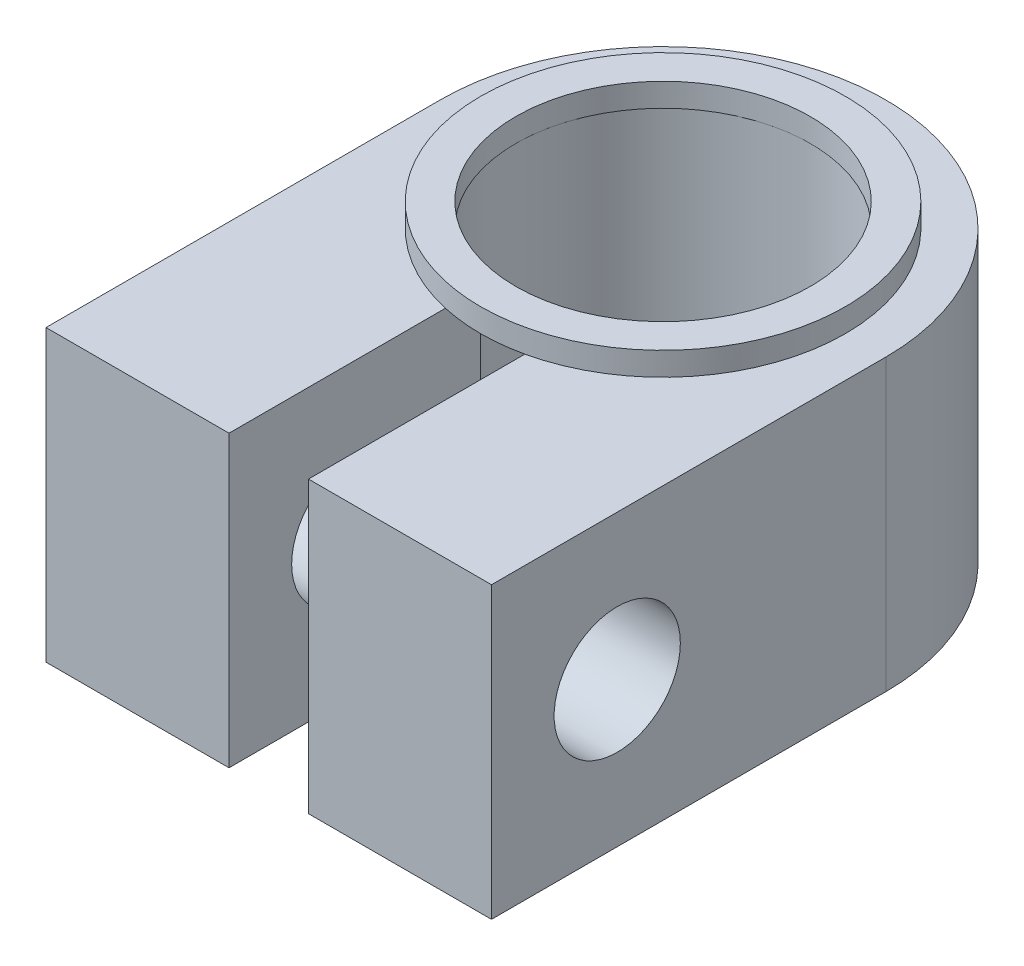
ISO-10303-21;
HEADER;
FILE_DESCRIPTION(('STEP AP214'),'2;1');
FILE_NAME('part.step','',(''),(''),'','','');
FILE_SCHEMA(('AUTOMOTIVE_DESIGN { 1 0 10303 214 1 1 1 1 }'));
ENDSEC;
DATA;
#1=APPLICATION_CONTEXT('core data for automotive mechanical design processes');
#2=APPLICATION_PROTOCOL_DEFINITION('international standard','automotive_design',2000,#1);
#3=PRODUCT_CONTEXT('',#1,'mechanical');
#4=PRODUCT('Part','Part','',(#3));
#5=PRODUCT_RELATED_PRODUCT_CATEGORY('part','',(#4));
#6=PRODUCT_DEFINITION_FORMATION('','',#4);
#7=PRODUCT_DEFINITION_CONTEXT('part definition',#1,'design');
#8=PRODUCT_DEFINITION('design','',#6,#7);
#9=PRODUCT_DEFINITION_SHAPE('','',#8);
#10=(LENGTH_UNIT() NAMED_UNIT(*) SI_UNIT(.MILLI.,.METRE.));
#11=(NAMED_UNIT(*) PLANE_ANGLE_UNIT() SI_UNIT($,.RADIAN.));
#12=(NAMED_UNIT(*) SI_UNIT($,.STERADIAN.) SOLID_ANGLE_UNIT());
#13=UNCERTAINTY_MEASURE_WITH_UNIT(LENGTH_MEASURE(1.E-05),#10,'distance_accuracy_value','');
#14=(GEOMETRIC_REPRESENTATION_CONTEXT(3) GLOBAL_UNCERTAINTY_ASSIGNED_CONTEXT((#13)) GLOBAL_UNIT_ASSIGNED_CONTEXT((#10,
#11,#12)) REPRESENTATION_CONTEXT('',''));
#15=CARTESIAN_POINT('',(0.,0.,0.));
#16=DIRECTION('',(0.,0.,1.));
#17=DIRECTION('',(1.,0.,0.));
#18=AXIS2_PLACEMENT_3D('',#15,#16,#17);
#19=CARTESIAN_POINT('',(0.,6.2,2.325));
#20=DIRECTION('',(0.,0.,-1.));
#21=DIRECTION('',(-1.,0.,0.));
#22=AXIS2_PLACEMENT_3D('',#19,#20,#21);
#23=PLANE('',#22);
#24=DIRECTION('',(1.,0.,0.));
#25=VECTOR('',#24,1.);
#26=CARTESIAN_POINT('',(0.,0.,2.325));
#27=LINE('',#26,#25);
#28=CARTESIAN_POINT('',(-4.765,0.,2.325));
#29=VERTEX_POINT('',#28);
#30=CARTESIAN_POINT('',(-0.85,0.,2.325));
#31=VERTEX_POINT('',#30);
#32=EDGE_CURVE('E165',#29,#31,#27,.T.);
#33=ORIENTED_EDGE('',*,*,#32,.T.);
#34=DIRECTION('',(0.,1.,0.));
#35=VECTOR('',#34,1.);
#36=CARTESIAN_POINT('',(-0.85,0.,2.325));
#37=LINE('',#36,#35);
#38=CARTESIAN_POINT('',(-0.85,6.2,2.325));
#39=VERTEX_POINT('',#38);
#40=EDGE_CURVE('E149',#31,#39,#37,.T.);
#41=ORIENTED_EDGE('',*,*,#40,.T.);
#42=DIRECTION('',(1.,0.,0.));
#43=VECTOR('',#42,1.);
#44=CARTESIAN_POINT('',(0.,6.2,2.325));
#45=LINE('',#44,#43);
#46=CARTESIAN_POINT('',(-4.765,6.2,2.325));
#47=VERTEX_POINT('',#46);
#48=EDGE_CURVE('E121',#47,#39,#45,.T.);
#49=ORIENTED_EDGE('',*,*,#48,.F.);
#50=DIRECTION('',(0.,-1.,0.));
#51=VECTOR('',#50,1.);
#52=CARTESIAN_POINT('',(-4.765,6.2,2.325));
#53=LINE('',#52,#51);
#54=EDGE_CURVE('E183',#47,#29,#53,.T.);
#55=ORIENTED_EDGE('',*,*,#54,.T.);
#56=EDGE_LOOP('',(#33,#41,#49,#55));
#57=FACE_BOUND('',#56,.T.);
#58=ADVANCED_FACE('F35',(#57),#23,.F.);
#59=CARTESIAN_POINT('',(4.765,6.2,0.));
#60=DIRECTION('',(1.,0.,0.));
#61=DIRECTION('',(0.,0.,-1.));
#62=AXIS2_PLACEMENT_3D('',#59,#60,#61);
#63=PLANE('',#62);
#64=CARTESIAN_POINT('',(4.765,3.1,-0.365));
#65=DIRECTION('',(1.,0.,0.));
#66=DIRECTION('',(0.,0.,-1.));
#67=AXIS2_PLACEMENT_3D('',#64,#65,#66);
#68=CIRCLE('',#67,1.35);
#69=CARTESIAN_POINT('',(4.765,3.1,-1.715));
#70=VERTEX_POINT('',#69);
#71=EDGE_CURVE('E131',#70,#70,#68,.T.);
#72=ORIENTED_EDGE('',*,*,#71,.F.);
#73=EDGE_LOOP('',(#72));
#74=FACE_BOUND('',#73,.T.);
#75=DIRECTION('',(0.,0.,1.));
#76=VECTOR('',#75,1.);
#77=CARTESIAN_POINT('',(4.765,0.,0.));
#78=LINE('',#77,#76);
#79=CARTESIAN_POINT('',(4.765,0.,-6.11));
#80=VERTEX_POINT('',#79);
#81=CARTESIAN_POINT('',(4.765,0.,2.325));
#82=VERTEX_POINT('',#81);
#83=EDGE_CURVE('E159',#80,#82,#78,.T.);
#84=ORIENTED_EDGE('',*,*,#83,.F.);
#85=DIRECTION('',(0.,-1.,0.));
#86=VECTOR('',#85,1.);
#87=CARTESIAN_POINT('',(4.765,6.2,-6.11));
#88=LINE('',#87,#86);
#89=CARTESIAN_POINT('',(4.765,6.2,-6.11));
#90=VERTEX_POINT('',#89);
#91=EDGE_CURVE('E189',#90,#80,#88,.T.);
#92=ORIENTED_EDGE('',*,*,#91,.F.);
#93=DIRECTION('',(0.,0.,1.));
#94=VECTOR('',#93,1.);
#95=CARTESIAN_POINT('',(4.765,6.2,0.));
#96=LINE('',#95,#94);
#97=CARTESIAN_POINT('',(4.765,6.2,2.325));
#98=VERTEX_POINT('',#97);
#99=EDGE_CURVE('E161',#90,#98,#96,.T.);
#100=ORIENTED_EDGE('',*,*,#99,.T.);
#101=DIRECTION('',(0.,-1.,0.));
#102=VECTOR('',#101,1.);
#103=CARTESIAN_POINT('',(4.765,6.2,2.325));
#104=LINE('',#103,#102);
#105=EDGE_CURVE('E171',#98,#82,#104,.T.);
#106=ORIENTED_EDGE('',*,*,#105,.T.);
#107=EDGE_LOOP('',(#84,#92,#100,#106));
#108=FACE_BOUND('',#107,.T.);
#109=ADVANCED_FACE('F37',(#74,#108),#63,.T.);
#110=CARTESIAN_POINT('',(0.,6.2,-6.11));
#111=DIRECTION('',(0.,-1.,0.));
#112=DIRECTION('',(0.,0.,-1.));
#113=AXIS2_PLACEMENT_3D('',#110,#111,#112);
#114=CYLINDRICAL_SURFACE('',#113,4.765);
#115=CARTESIAN_POINT('',(0.,0.,-6.11));
#116=DIRECTION('',(0.,1.,0.));
#117=DIRECTION('',(0.,0.,1.));
#118=AXIS2_PLACEMENT_3D('',#115,#116,#117);
#119=CIRCLE('',#118,4.765);
#120=CARTESIAN_POINT('',(-4.765,0.,-6.11));
#121=VERTEX_POINT('',#120);
#122=EDGE_CURVE('E174',#80,#121,#119,.T.);
#123=ORIENTED_EDGE('',*,*,#122,.T.);
#124=DIRECTION('',(0.,-1.,0.));
#125=VECTOR('',#124,1.);
#126=CARTESIAN_POINT('',(-4.765,6.2,-6.11));
#127=LINE('',#126,#125);
#128=CARTESIAN_POINT('',(-4.765,6.2,-6.11));
#129=VERTEX_POINT('',#128);
#130=EDGE_CURVE('E186',#129,#121,#127,.T.);
#131=ORIENTED_EDGE('',*,*,#130,.F.);
#132=CARTESIAN_POINT('',(0.,6.2,-6.11));
#133=DIRECTION('',(0.,1.,0.));
#134=DIRECTION('',(0.,0.,1.));
#135=AXIS2_PLACEMENT_3D('',#132,#133,#134);
#136=CIRCLE('',#135,4.765);
#137=EDGE_CURVE('E164',#90,#129,#136,.T.);
#138=ORIENTED_EDGE('',*,*,#137,.F.);
#139=ORIENTED_EDGE('',*,*,#91,.T.);
#140=EDGE_LOOP('',(#123,#131,#138,#139));
#141=FACE_BOUND('',#140,.T.);
#142=ADVANCED_FACE('F217',(#141),#114,.T.);
#143=CARTESIAN_POINT('',(-4.765,6.2,0.));
#144=DIRECTION('',(1.,0.,0.));
#145=DIRECTION('',(0.,0.,-1.));
#146=AXIS2_PLACEMENT_3D('',#143,#144,#145);
#147=PLANE('',#146);
#148=CARTESIAN_POINT('',(-4.765,3.1,-0.365000000000002));
#149=DIRECTION('',(1.,0.,0.));
#150=DIRECTION('',(0.,0.,-1.));
#151=AXIS2_PLACEMENT_3D('',#148,#149,#150);
#152=CIRCLE('',#151,1.35);
#153=CARTESIAN_POINT('',(-4.765,3.1,-1.715));
#154=VERTEX_POINT('',#153);
#155=EDGE_CURVE('E135',#154,#154,#152,.T.);
#156=ORIENTED_EDGE('',*,*,#155,.T.);
#157=EDGE_LOOP('',(#156));
#158=FACE_BOUND('',#157,.T.);
#159=DIRECTION('',(0.,0.,1.));
#160=VECTOR('',#159,1.);
#161=CARTESIAN_POINT('',(-4.765,0.,0.));
#162=LINE('',#161,#160);
#163=EDGE_CURVE('E176',#121,#29,#162,.T.);
#164=ORIENTED_EDGE('',*,*,#163,.T.);
#165=ORIENTED_EDGE('',*,*,#54,.F.);
#166=DIRECTION('',(0.,0.,1.));
#167=VECTOR('',#166,1.);
#168=CARTESIAN_POINT('',(-4.765,6.2,0.));
#169=LINE('',#168,#167);
#170=EDGE_CURVE('E167',#129,#47,#169,.T.);
#171=ORIENTED_EDGE('',*,*,#170,.F.);
#172=ORIENTED_EDGE('',*,*,#130,.T.);
#173=EDGE_LOOP('',(#164,#165,#171,#172));
#174=FACE_BOUND('',#173,.T.);
#175=ADVANCED_FACE('F222',(#158,#174),#147,.F.);
#176=CARTESIAN_POINT('',(0.85,6.2,2.325));
#177=VERTEX_POINT('',#176);
#178=EDGE_CURVE('E169',#177,#98,#45,.T.);
#179=ORIENTED_EDGE('',*,*,#178,.F.);
#180=DIRECTION('',(0.,1.,0.));
#181=VECTOR('',#180,1.);
#182=CARTESIAN_POINT('',(0.85,0.,2.325));
#183=LINE('',#182,#181);
#184=CARTESIAN_POINT('',(0.85,0.,2.325));
#185=VERTEX_POINT('',#184);
#186=EDGE_CURVE('E152',#185,#177,#183,.T.);
#187=ORIENTED_EDGE('',*,*,#186,.F.);
#188=EDGE_CURVE('E178',#185,#82,#27,.T.);
#189=ORIENTED_EDGE('',*,*,#188,.T.);
#190=ORIENTED_EDGE('',*,*,#105,.F.);
#191=EDGE_LOOP('',(#179,#187,#189,#190));
#192=FACE_BOUND('',#191,.T.);
#193=ADVANCED_FACE('F213',(#192),#23,.F.);
#194=CARTESIAN_POINT('',(0.,6.2,0.));
#195=DIRECTION('',(0.,1.,0.));
#196=DIRECTION('',(0.,0.,1.));
#197=AXIS2_PLACEMENT_3D('',#194,#195,#196);
#198=PLANE('',#197);
#199=CARTESIAN_POINT('',(0.,6.2,-6.11));
#200=DIRECTION('',(0.,1.,0.));
#201=DIRECTION('',(0.,0.,1.));
#202=AXIS2_PLACEMENT_3D('',#199,#200,#201);
#203=CIRCLE('',#202,3.9);
#204=CARTESIAN_POINT('',(0.85,6.2,-2.30375513136635));
#205=VERTEX_POINT('',#204);
#206=CARTESIAN_POINT('',(-0.85,6.2,-2.30375513136635));
#207=VERTEX_POINT('',#206);
#208=EDGE_CURVE('E52',#205,#207,#203,.T.);
#209=ORIENTED_EDGE('',*,*,#208,.F.);
#210=DIRECTION('',(0.,0.,-1.));
#211=VECTOR('',#210,1.);
#212=CARTESIAN_POINT('',(0.85,6.2,2.325));
#213=LINE('',#212,#211);
#214=EDGE_CURVE('E147',#177,#205,#213,.T.);
#215=ORIENTED_EDGE('',*,*,#214,.F.);
#216=ORIENTED_EDGE('',*,*,#178,.T.);
#217=ORIENTED_EDGE('',*,*,#99,.F.);
#218=ORIENTED_EDGE('',*,*,#137,.T.);
#219=ORIENTED_EDGE('',*,*,#170,.T.);
#220=ORIENTED_EDGE('',*,*,#48,.T.);
#221=DIRECTION('',(0.,0.,1.));
#222=VECTOR('',#221,1.);
#223=CARTESIAN_POINT('',(-0.85,6.2,2.325));
#224=LINE('',#223,#222);
#225=EDGE_CURVE('E111',#207,#39,#224,.T.);
#226=ORIENTED_EDGE('',*,*,#225,.F.);
#227=EDGE_LOOP('',(#209,#215,#216,#217,#218,#219,#220,#226));
#228=FACE_BOUND('',#227,.T.);
#229=ADVANCED_FACE('F119',(#228),#198,.T.);
#230=CARTESIAN_POINT('',(0.,0.,0.));
#231=DIRECTION('',(0.,1.,0.));
#232=DIRECTION('',(0.,0.,1.));
#233=AXIS2_PLACEMENT_3D('',#230,#231,#232);
#234=PLANE('',#233);
#235=CARTESIAN_POINT('',(0.,0.,-6.11));
#236=DIRECTION('',(0.,1.,0.));
#237=DIRECTION('',(0.,0.,1.));
#238=AXIS2_PLACEMENT_3D('',#235,#236,#237);
#239=CIRCLE('',#238,3.175);
#240=CARTESIAN_POINT('',(0.85,0.,-3.05089473865315));
#241=VERTEX_POINT('',#240);
#242=CARTESIAN_POINT('',(-0.85,0.,-3.05089473865315));
#243=VERTEX_POINT('',#242);
#244=EDGE_CURVE('E156',#241,#243,#239,.T.);
#245=ORIENTED_EDGE('',*,*,#244,.T.);
#246=DIRECTION('',(0.,0.,1.));
#247=VECTOR('',#246,1.);
#248=CARTESIAN_POINT('',(-0.85,0.,2.325));
#249=LINE('',#248,#247);
#250=EDGE_CURVE('E143',#243,#31,#249,.T.);
#251=ORIENTED_EDGE('',*,*,#250,.T.);
#252=ORIENTED_EDGE('',*,*,#32,.F.);
#253=ORIENTED_EDGE('',*,*,#163,.F.);
#254=ORIENTED_EDGE('',*,*,#122,.F.);
#255=ORIENTED_EDGE('',*,*,#83,.T.);
#256=ORIENTED_EDGE('',*,*,#188,.F.);
#257=DIRECTION('',(0.,0.,-1.));
#258=VECTOR('',#257,1.);
#259=CARTESIAN_POINT('',(0.85,0.,2.325));
#260=LINE('',#259,#258);
#261=EDGE_CURVE('E146',#185,#241,#260,.T.);
#262=ORIENTED_EDGE('',*,*,#261,.T.);
#263=EDGE_LOOP('',(#245,#251,#252,#253,#254,#255,#256,#262));
#264=FACE_BOUND('',#263,.T.);
#265=ADVANCED_FACE('F228',(#264),#234,.F.);
#266=CARTESIAN_POINT('',(0.,0.,-6.11));
#267=DIRECTION('',(0.,1.,0.));
#268=DIRECTION('',(0.,0.,1.));
#269=AXIS2_PLACEMENT_3D('',#266,#267,#268);
#270=CYLINDRICAL_SURFACE('',#269,3.175);
#271=CARTESIAN_POINT('',(0.,6.2,-6.11));
#272=DIRECTION('',(0.,1.,0.));
#273=DIRECTION('',(0.,0.,1.));
#274=AXIS2_PLACEMENT_3D('',#271,#272,#273);
#275=CIRCLE('',#274,3.175);
#276=CARTESIAN_POINT('',(0.85,6.2,-3.05089473865315));
#277=VERTEX_POINT('',#276);
#278=CARTESIAN_POINT('',(-0.85,6.2,-3.05089473865315));
#279=VERTEX_POINT('',#278);
#280=EDGE_CURVE('E154',#277,#279,#275,.T.);
#281=ORIENTED_EDGE('',*,*,#280,.T.);
#282=DIRECTION('',(0.,1.,0.));
#283=VECTOR('',#282,1.);
#284=CARTESIAN_POINT('',(-0.85,0.,-3.05089473865315));
#285=LINE('',#284,#283);
#286=EDGE_CURVE('E11',#279,#243,#285,.F.);
#287=ORIENTED_EDGE('',*,*,#286,.T.);
#288=ORIENTED_EDGE('',*,*,#244,.F.);
#289=DIRECTION('',(0.,1.,0.));
#290=VECTOR('',#289,1.);
#291=CARTESIAN_POINT('',(0.85,0.,-3.05089473865315));
#292=LINE('',#291,#290);
#293=EDGE_CURVE('E44',#241,#277,#292,.T.);
#294=ORIENTED_EDGE('',*,*,#293,.T.);
#295=EDGE_LOOP('',(#281,#287,#288,#294));
#296=FACE_BOUND('',#295,.T.);
#297=ADVANCED_FACE('F239',(#296),#270,.F.);
#298=CARTESIAN_POINT('',(0.85,0.,2.325));
#299=DIRECTION('',(1.,0.,0.));
#300=DIRECTION('',(0.,0.,-1.));
#301=AXIS2_PLACEMENT_3D('',#298,#299,#300);
#302=PLANE('',#301);
#303=CARTESIAN_POINT('',(0.85,3.1,-0.365000000000001));
#304=DIRECTION('',(1.,0.,0.));
#305=DIRECTION('',(0.,0.,-1.));
#306=AXIS2_PLACEMENT_3D('',#303,#304,#305);
#307=CIRCLE('',#306,1.35);
#308=CARTESIAN_POINT('',(0.85,3.1,-1.715));
#309=VERTEX_POINT('',#308);
#310=EDGE_CURVE('E122',#309,#309,#307,.T.);
#311=ORIENTED_EDGE('',*,*,#310,.T.);
#312=EDGE_LOOP('',(#311));
#313=FACE_BOUND('',#312,.T.);
#314=ORIENTED_EDGE('',*,*,#261,.F.);
#315=ORIENTED_EDGE('',*,*,#186,.T.);
#316=ORIENTED_EDGE('',*,*,#214,.T.);
#317=EDGE_CURVE('E59',#205,#277,#213,.T.);
#318=ORIENTED_EDGE('',*,*,#317,.T.);
#319=ORIENTED_EDGE('',*,*,#293,.F.);
#320=EDGE_LOOP('',(#314,#315,#316,#318,#319));
#321=FACE_BOUND('',#320,.T.);
#322=ADVANCED_FACE('F205',(#313,#321),#302,.F.);
#323=CARTESIAN_POINT('',(-0.85,0.,2.325));
#324=DIRECTION('',(-1.,0.,0.));
#325=DIRECTION('',(0.,0.,1.));
#326=AXIS2_PLACEMENT_3D('',#323,#324,#325);
#327=PLANE('',#326);
#328=CARTESIAN_POINT('',(-0.85,3.1,-0.365000000000001));
#329=DIRECTION('',(-1.,0.,0.));
#330=DIRECTION('',(0.,0.,1.));
#331=AXIS2_PLACEMENT_3D('',#328,#329,#330);
#332=CIRCLE('',#331,1.35);
#333=CARTESIAN_POINT('',(-0.85,3.1,0.984999999999999));
#334=VERTEX_POINT('',#333);
#335=EDGE_CURVE('E138',#334,#334,#332,.T.);
#336=ORIENTED_EDGE('',*,*,#335,.T.);
#337=EDGE_LOOP('',(#336));
#338=FACE_BOUND('',#337,.T.);
#339=EDGE_CURVE('E109',#279,#207,#224,.T.);
#340=ORIENTED_EDGE('',*,*,#339,.T.);
#341=ORIENTED_EDGE('',*,*,#225,.T.);
#342=ORIENTED_EDGE('',*,*,#40,.F.);
#343=ORIENTED_EDGE('',*,*,#250,.F.);
#344=ORIENTED_EDGE('',*,*,#286,.F.);
#345=EDGE_LOOP('',(#340,#341,#342,#343,#344));
#346=FACE_BOUND('',#345,.T.);
#347=ADVANCED_FACE('F110',(#338,#346),#327,.F.);
#348=CARTESIAN_POINT('',(-4.765,3.1,-0.365000000000002));
#349=DIRECTION('',(1.,0.,0.));
#350=DIRECTION('',(0.,0.,-1.));
#351=AXIS2_PLACEMENT_3D('',#348,#349,#350);
#352=CYLINDRICAL_SURFACE('',#351,1.35);
#353=ORIENTED_EDGE('',*,*,#155,.F.);
#354=EDGE_LOOP('',(#353));
#355=FACE_BOUND('',#354,.T.);
#356=ORIENTED_EDGE('',*,*,#335,.F.);
#357=EDGE_LOOP('',(#356));
#358=FACE_BOUND('',#357,.T.);
#359=ADVANCED_FACE('F195',(#355,#358),#352,.F.);
#360=ORIENTED_EDGE('',*,*,#71,.T.);
#361=EDGE_LOOP('',(#360));
#362=FACE_BOUND('',#361,.T.);
#363=ORIENTED_EDGE('',*,*,#310,.F.);
#364=EDGE_LOOP('',(#363));
#365=FACE_BOUND('',#364,.T.);
#366=ADVANCED_FACE('F197',(#362,#365),#352,.F.);
#367=CARTESIAN_POINT('',(0.,6.7,-6.11));
#368=DIRECTION('',(0.,-1.,0.));
#369=DIRECTION('',(0.,0.,-1.));
#370=AXIS2_PLACEMENT_3D('',#367,#368,#369);
#371=CYLINDRICAL_SURFACE('',#370,3.9);
#372=CARTESIAN_POINT('',(0.,6.7,-6.11));
#373=DIRECTION('',(0.,1.,0.));
#374=DIRECTION('',(0.,0.,1.));
#375=AXIS2_PLACEMENT_3D('',#372,#373,#374);
#376=CIRCLE('',#375,3.9);
#377=CARTESIAN_POINT('',(0.,6.7,-2.21));
#378=VERTEX_POINT('',#377);
#379=EDGE_CURVE('E129',#378,#378,#376,.T.);
#380=ORIENTED_EDGE('',*,*,#379,.F.);
#381=EDGE_LOOP('',(#380));
#382=FACE_BOUND('',#381,.T.);
#383=ORIENTED_EDGE('',*,*,#208,.T.);
#384=EDGE_CURVE('E124',#207,#205,#203,.T.);
#385=ORIENTED_EDGE('',*,*,#384,.T.);
#386=EDGE_LOOP('',(#383,#385));
#387=FACE_BOUND('',#386,.T.);
#388=ADVANCED_FACE('F128',(#382,#387),#371,.T.);
#389=CARTESIAN_POINT('',(0.,6.7,-6.11));
#390=DIRECTION('',(0.,1.,0.));
#391=DIRECTION('',(0.,0.,1.));
#392=AXIS2_PLACEMENT_3D('',#389,#390,#391);
#393=PLANE('',#392);
#394=CARTESIAN_POINT('',(0.,6.7,-6.11));
#395=DIRECTION('',(0.,1.,0.));
#396=DIRECTION('',(0.,0.,1.));
#397=AXIS2_PLACEMENT_3D('',#394,#395,#396);
#398=CIRCLE('',#397,3.15);
#399=CARTESIAN_POINT('',(0.,6.7,-2.96));
#400=VERTEX_POINT('',#399);
#401=EDGE_CURVE('E321',#400,#400,#398,.T.);
#402=ORIENTED_EDGE('',*,*,#401,.F.);
#403=EDGE_LOOP('',(#402));
#404=FACE_BOUND('',#403,.T.);
#405=ORIENTED_EDGE('',*,*,#379,.T.);
#406=EDGE_LOOP('',(#405));
#407=FACE_BOUND('',#406,.T.);
#408=ADVANCED_FACE('F286',(#404,#407),#393,.T.);
#409=CARTESIAN_POINT('',(0.,6.2,-6.11));
#410=DIRECTION('',(0.,1.,0.));
#411=DIRECTION('',(0.,0.,1.));
#412=AXIS2_PLACEMENT_3D('',#409,#410,#411);
#413=PLANE('',#412);
#414=CARTESIAN_POINT('',(0.,6.2,-6.11));
#415=DIRECTION('',(0.,1.,0.));
#416=DIRECTION('',(0.,0.,1.));
#417=AXIS2_PLACEMENT_3D('',#414,#415,#416);
#418=CIRCLE('',#417,3.15);
#419=CARTESIAN_POINT('',(0.,6.2,-2.96));
#420=VERTEX_POINT('',#419);
#421=EDGE_CURVE('E39',#420,#420,#418,.T.);
#422=ORIENTED_EDGE('',*,*,#421,.T.);
#423=EDGE_LOOP('',(#422));
#424=FACE_BOUND('',#423,.T.);
#425=ORIENTED_EDGE('',*,*,#339,.F.);
#426=ORIENTED_EDGE('',*,*,#280,.F.);
#427=ORIENTED_EDGE('',*,*,#317,.F.);
#428=ORIENTED_EDGE('',*,*,#384,.F.);
#429=EDGE_LOOP('',(#425,#426,#427,#428));
#430=FACE_BOUND('',#429,.T.);
#431=ADVANCED_FACE('F125',(#424,#430),#413,.F.);
#432=CARTESIAN_POINT('',(0.,0.,-6.11));
#433=DIRECTION('',(0.,1.,0.));
#434=DIRECTION('',(0.,0.,1.));
#435=AXIS2_PLACEMENT_3D('',#432,#433,#434);
#436=CYLINDRICAL_SURFACE('',#435,3.15);
#437=ORIENTED_EDGE('',*,*,#401,.T.);
#438=EDGE_LOOP('',(#437));
#439=FACE_BOUND('',#438,.T.);
#440=ORIENTED_EDGE('',*,*,#421,.F.);
#441=EDGE_LOOP('',(#440));
#442=FACE_BOUND('',#441,.T.);
#443=ADVANCED_FACE('F304',(#439,#442),#436,.F.);
#444=CLOSED_SHELL('',(#58,#109,#142,#175,#193,#229,#265,#297,#322,#347,#359,#366,#388,#408,#431,#443));
#445=MANIFOLD_SOLID_BREP('B2',#444);
#446=ADVANCED_BREP_SHAPE_REPRESENTATION('',(#18,#445),#14);
#447=SHAPE_DEFINITION_REPRESENTATION(#9,#446);
ENDSEC;
END-ISO-10303-21;
